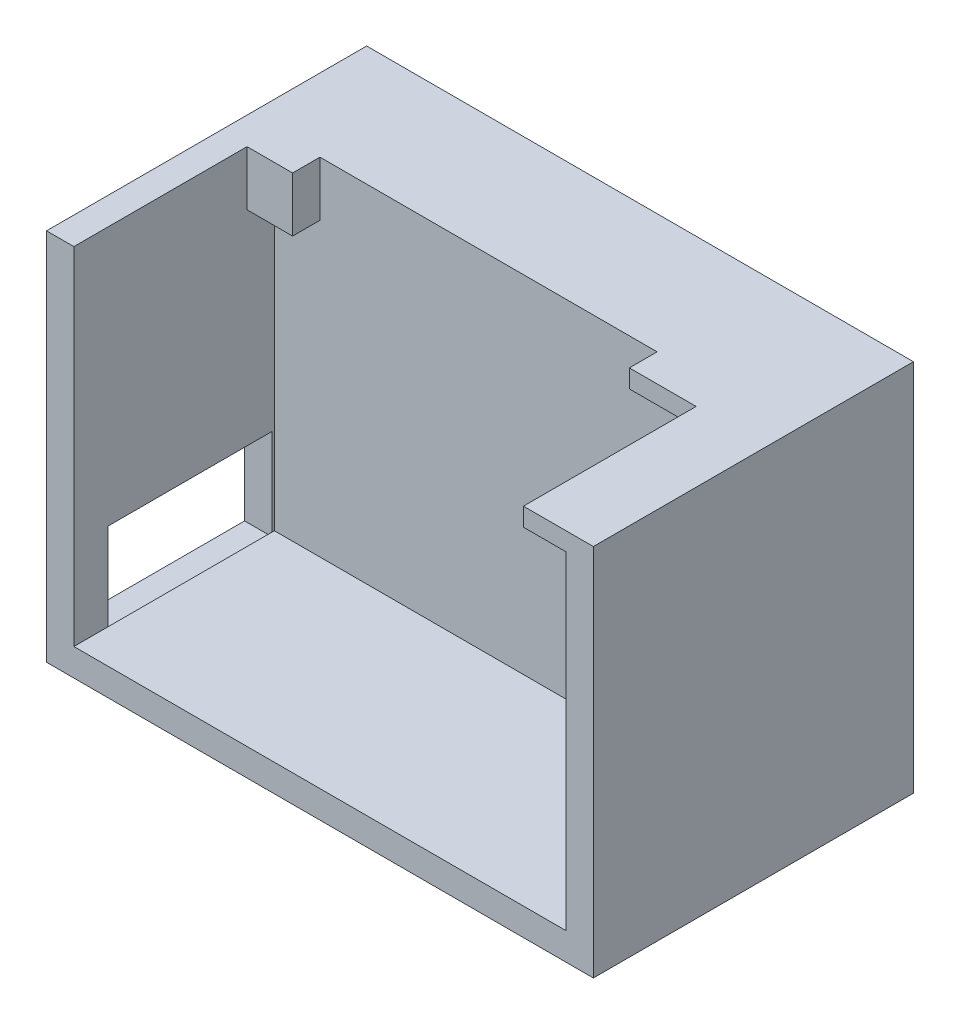
ISO-10303-21;
HEADER;
FILE_DESCRIPTION(('STEP AP214'),'2;1');
FILE_NAME('part.step','',(''),(''),'','','');
FILE_SCHEMA(('AUTOMOTIVE_DESIGN { 1 0 10303 214 1 1 1 1 }'));
ENDSEC;
DATA;
#1=APPLICATION_CONTEXT('core data for automotive mechanical design processes');
#2=APPLICATION_PROTOCOL_DEFINITION('international standard','automotive_design',2000,#1);
#3=PRODUCT_CONTEXT('',#1,'mechanical');
#4=PRODUCT('Part','Part','',(#3));
#5=PRODUCT_RELATED_PRODUCT_CATEGORY('part','',(#4));
#6=PRODUCT_DEFINITION_FORMATION('','',#4);
#7=PRODUCT_DEFINITION_CONTEXT('part definition',#1,'design');
#8=PRODUCT_DEFINITION('design','',#6,#7);
#9=PRODUCT_DEFINITION_SHAPE('','',#8);
#10=(LENGTH_UNIT() NAMED_UNIT(*) SI_UNIT(.MILLI.,.METRE.));
#11=(NAMED_UNIT(*) PLANE_ANGLE_UNIT() SI_UNIT($,.RADIAN.));
#12=(NAMED_UNIT(*) SI_UNIT($,.STERADIAN.) SOLID_ANGLE_UNIT());
#13=UNCERTAINTY_MEASURE_WITH_UNIT(LENGTH_MEASURE(1.E-05),#10,'distance_accuracy_value','');
#14=(GEOMETRIC_REPRESENTATION_CONTEXT(3) GLOBAL_UNCERTAINTY_ASSIGNED_CONTEXT((#13)) GLOBAL_UNIT_ASSIGNED_CONTEXT((#10,
#11,#12)) REPRESENTATION_CONTEXT('',''));
#15=CARTESIAN_POINT('',(0.,0.,0.));
#16=DIRECTION('',(0.,0.,1.));
#17=DIRECTION('',(1.,0.,0.));
#18=AXIS2_PLACEMENT_3D('',#15,#16,#17);
#19=CARTESIAN_POINT('',(3.,0.,35.125));
#20=DIRECTION('',(1.,0.,0.));
#21=DIRECTION('',(0.,1.,0.));
#22=AXIS2_PLACEMENT_3D('',#19,#20,#21);
#23=PLANE('',#22);
#24=DIRECTION('',(0.,-1.,0.));
#25=VECTOR('',#24,1.);
#26=CARTESIAN_POINT('',(2.99999999999999,39.,13.125));
#27=LINE('',#26,#25);
#28=CARTESIAN_POINT('',(2.99999999999999,35.,13.125));
#29=VERTEX_POINT('',#28);
#30=CARTESIAN_POINT('',(3.,3.,13.125));
#31=VERTEX_POINT('',#30);
#32=EDGE_CURVE('E270',#29,#31,#27,.T.);
#33=ORIENTED_EDGE('',*,*,#32,.F.);
#34=DIRECTION('',(0.,0.,-1.));
#35=VECTOR('',#34,1.);
#36=CARTESIAN_POINT('',(2.99999999999999,35.,16.125));
#37=LINE('',#36,#35);
#38=CARTESIAN_POINT('',(2.99999999999999,35.,16.125));
#39=VERTEX_POINT('',#38);
#40=EDGE_CURVE('E58',#39,#29,#37,.T.);
#41=ORIENTED_EDGE('',*,*,#40,.F.);
#42=DIRECTION('',(0.,-1.,0.));
#43=VECTOR('',#42,1.);
#44=CARTESIAN_POINT('',(2.99999999999999,41.,16.125));
#45=LINE('',#44,#43);
#46=CARTESIAN_POINT('',(2.99999999999999,41.,16.125));
#47=VERTEX_POINT('',#46);
#48=EDGE_CURVE('E187',#47,#39,#45,.T.);
#49=ORIENTED_EDGE('',*,*,#48,.F.);
#50=DIRECTION('',(0.,0.,1.));
#51=VECTOR('',#50,1.);
#52=CARTESIAN_POINT('',(2.99999999999999,41.,0.));
#53=LINE('',#52,#51);
#54=CARTESIAN_POINT('',(2.99999999999999,41.,35.125));
#55=VERTEX_POINT('',#54);
#56=EDGE_CURVE('E51',#47,#55,#53,.T.);
#57=ORIENTED_EDGE('',*,*,#56,.T.);
#58=DIRECTION('',(0.,-1.,0.));
#59=VECTOR('',#58,1.);
#60=CARTESIAN_POINT('',(3.,0.,35.125));
#61=LINE('',#60,#59);
#62=CARTESIAN_POINT('',(3.,3.,35.125));
#63=VERTEX_POINT('',#62);
#64=EDGE_CURVE('E281',#55,#63,#61,.T.);
#65=ORIENTED_EDGE('',*,*,#64,.T.);
#66=DIRECTION('',(0.,0.,-1.));
#67=VECTOR('',#66,1.);
#68=CARTESIAN_POINT('',(3.,3.,35.125));
#69=LINE('',#68,#67);
#70=CARTESIAN_POINT('',(3.,3.,31.3951101952654));
#71=VERTEX_POINT('',#70);
#72=EDGE_CURVE('E282',#63,#71,#69,.T.);
#73=ORIENTED_EDGE('',*,*,#72,.T.);
#74=DIRECTION('',(0.,1.,0.));
#75=VECTOR('',#74,1.);
#76=CARTESIAN_POINT('',(3.,12.5683185883645,31.3951101952654));
#77=LINE('',#76,#75);
#78=CARTESIAN_POINT('',(3.,12.5683185883645,31.3951101952654));
#79=VERTEX_POINT('',#78);
#80=EDGE_CURVE('E235',#71,#79,#77,.T.);
#81=ORIENTED_EDGE('',*,*,#80,.T.);
#82=DIRECTION('',(0.,0.,-1.));
#83=VECTOR('',#82,1.);
#84=CARTESIAN_POINT('',(3.,12.5683185883645,13.3951101952654));
#85=LINE('',#84,#83);
#86=CARTESIAN_POINT('',(3.,12.5683185883645,13.3951101952654));
#87=VERTEX_POINT('',#86);
#88=EDGE_CURVE('E238',#79,#87,#85,.T.);
#89=ORIENTED_EDGE('',*,*,#88,.T.);
#90=DIRECTION('',(0.,-1.,0.));
#91=VECTOR('',#90,1.);
#92=CARTESIAN_POINT('',(3.,12.5683185883645,13.3951101952654));
#93=LINE('',#92,#91);
#94=CARTESIAN_POINT('',(3.,3.,13.3951101952654));
#95=VERTEX_POINT('',#94);
#96=EDGE_CURVE('E228',#87,#95,#93,.T.);
#97=ORIENTED_EDGE('',*,*,#96,.T.);
#98=EDGE_CURVE('E287',#95,#31,#69,.T.);
#99=ORIENTED_EDGE('',*,*,#98,.T.);
#100=EDGE_LOOP('',(#33,#41,#49,#57,#65,#73,#81,#89,#97,#99));
#101=FACE_BOUND('',#100,.T.);
#102=ADVANCED_FACE('F43',(#101),#23,.T.);
#103=CARTESIAN_POINT('',(0.,0.,13.125));
#104=DIRECTION('',(0.,0.,1.));
#105=DIRECTION('',(1.,0.,0.));
#106=AXIS2_PLACEMENT_3D('',#103,#104,#105);
#107=PLANE('',#106);
#108=DIRECTION('',(0.,1.,0.));
#109=VECTOR('',#108,1.);
#110=CARTESIAN_POINT('',(7.99999999999999,41.,13.125));
#111=LINE('',#110,#109);
#112=CARTESIAN_POINT('',(7.99999999999999,35.,13.125));
#113=VERTEX_POINT('',#112);
#114=CARTESIAN_POINT('',(7.99999999999999,41.,13.125));
#115=VERTEX_POINT('',#114);
#116=EDGE_CURVE('E66',#113,#115,#111,.T.);
#117=ORIENTED_EDGE('',*,*,#116,.F.);
#118=DIRECTION('',(1.,0.,0.));
#119=VECTOR('',#118,1.);
#120=CARTESIAN_POINT('',(2.99999999999999,35.,13.125));
#121=LINE('',#120,#119);
#122=EDGE_CURVE('E193',#29,#113,#121,.T.);
#123=ORIENTED_EDGE('',*,*,#122,.F.);
#124=ORIENTED_EDGE('',*,*,#32,.T.);
#125=DIRECTION('',(1.,0.,0.));
#126=VECTOR('',#125,1.);
#127=CARTESIAN_POINT('',(3.,3.,13.125));
#128=LINE('',#127,#126);
#129=CARTESIAN_POINT('',(57.,3.,13.125));
#130=VERTEX_POINT('',#129);
#131=EDGE_CURVE('E272',#31,#130,#128,.T.);
#132=ORIENTED_EDGE('',*,*,#131,.T.);
#133=DIRECTION('',(0.,1.,0.));
#134=VECTOR('',#133,1.);
#135=CARTESIAN_POINT('',(57.,39.,13.125));
#136=LINE('',#135,#134);
#137=CARTESIAN_POINT('',(57.,39.,13.125));
#138=VERTEX_POINT('',#137);
#139=EDGE_CURVE('E275',#130,#138,#136,.T.);
#140=ORIENTED_EDGE('',*,*,#139,.T.);
#141=DIRECTION('',(-1.,0.,0.));
#142=VECTOR('',#141,1.);
#143=CARTESIAN_POINT('',(2.99999999999999,39.,13.125));
#144=LINE('',#143,#142);
#145=CARTESIAN_POINT('',(45.,39.,13.125));
#146=VERTEX_POINT('',#145);
#147=EDGE_CURVE('E278',#138,#146,#144,.T.);
#148=ORIENTED_EDGE('',*,*,#147,.T.);
#149=DIRECTION('',(0.,-1.,0.));
#150=VECTOR('',#149,1.);
#151=CARTESIAN_POINT('',(45.,49.,13.125));
#152=LINE('',#151,#150);
#153=CARTESIAN_POINT('',(45.,41.,13.125));
#154=VERTEX_POINT('',#153);
#155=EDGE_CURVE('E225',#154,#146,#152,.T.);
#156=ORIENTED_EDGE('',*,*,#155,.F.);
#157=DIRECTION('',(-1.,0.,0.));
#158=VECTOR('',#157,1.);
#159=CARTESIAN_POINT('',(0.,41.,13.125));
#160=LINE('',#159,#158);
#161=EDGE_CURVE('E322',#154,#115,#160,.T.);
#162=ORIENTED_EDGE('',*,*,#161,.T.);
#163=EDGE_LOOP('',(#117,#123,#124,#132,#140,#148,#156,#162));
#164=FACE_BOUND('',#163,.T.);
#165=ADVANCED_FACE('F374',(#164),#107,.T.);
#166=CARTESIAN_POINT('',(0.,0.,35.125));
#167=DIRECTION('',(0.,0.,-1.));
#168=DIRECTION('',(-1.,0.,0.));
#169=AXIS2_PLACEMENT_3D('',#166,#167,#168);
#170=PLANE('',#169);
#171=DIRECTION('',(1.,0.,0.));
#172=VECTOR('',#171,1.);
#173=CARTESIAN_POINT('',(0.,41.,35.125));
#174=LINE('',#173,#172);
#175=CARTESIAN_POINT('',(52.3263332393032,41.,35.125));
#176=VERTEX_POINT('',#175);
#177=CARTESIAN_POINT('',(60.,41.,35.125));
#178=VERTEX_POINT('',#177);
#179=EDGE_CURVE('E262',#176,#178,#174,.T.);
#180=ORIENTED_EDGE('',*,*,#179,.F.);
#181=DIRECTION('',(0.,1.,0.));
#182=VECTOR('',#181,1.);
#183=CARTESIAN_POINT('',(52.3263332393032,37.,35.125));
#184=LINE('',#183,#182);
#185=CARTESIAN_POINT('',(52.3263332393032,39.,35.125));
#186=VERTEX_POINT('',#185);
#187=EDGE_CURVE('E214',#186,#176,#184,.T.);
#188=ORIENTED_EDGE('',*,*,#187,.F.);
#189=DIRECTION('',(-1.,0.,0.));
#190=VECTOR('',#189,1.);
#191=CARTESIAN_POINT('',(0.,39.,35.125));
#192=LINE('',#191,#190);
#193=CARTESIAN_POINT('',(57.,39.,35.125));
#194=VERTEX_POINT('',#193);
#195=EDGE_CURVE('E294',#194,#186,#192,.T.);
#196=ORIENTED_EDGE('',*,*,#195,.F.);
#197=DIRECTION('',(0.,1.,0.));
#198=VECTOR('',#197,1.);
#199=CARTESIAN_POINT('',(57.,0.,35.125));
#200=LINE('',#199,#198);
#201=CARTESIAN_POINT('',(57.,3.,35.125));
#202=VERTEX_POINT('',#201);
#203=EDGE_CURVE('E298',#202,#194,#200,.T.);
#204=ORIENTED_EDGE('',*,*,#203,.F.);
#205=DIRECTION('',(1.,0.,0.));
#206=VECTOR('',#205,1.);
#207=CARTESIAN_POINT('',(0.,3.,35.125));
#208=LINE('',#207,#206);
#209=EDGE_CURVE('E296',#63,#202,#208,.T.);
#210=ORIENTED_EDGE('',*,*,#209,.F.);
#211=ORIENTED_EDGE('',*,*,#64,.F.);
#212=CARTESIAN_POINT('',(0.,41.,35.125));
#213=VERTEX_POINT('',#212);
#214=EDGE_CURVE('E263',#213,#55,#174,.T.);
#215=ORIENTED_EDGE('',*,*,#214,.F.);
#216=DIRECTION('',(0.,-1.,0.));
#217=VECTOR('',#216,1.);
#218=CARTESIAN_POINT('',(0.,0.,35.125));
#219=LINE('',#218,#217);
#220=CARTESIAN_POINT('',(0.,0.,35.125));
#221=VERTEX_POINT('',#220);
#222=EDGE_CURVE('E303',#213,#221,#219,.T.);
#223=ORIENTED_EDGE('',*,*,#222,.T.);
#224=DIRECTION('',(1.,0.,0.));
#225=VECTOR('',#224,1.);
#226=CARTESIAN_POINT('',(0.,0.,35.125));
#227=LINE('',#226,#225);
#228=CARTESIAN_POINT('',(60.,0.,35.125));
#229=VERTEX_POINT('',#228);
#230=EDGE_CURVE('E305',#221,#229,#227,.T.);
#231=ORIENTED_EDGE('',*,*,#230,.T.);
#232=DIRECTION('',(0.,1.,0.));
#233=VECTOR('',#232,1.);
#234=CARTESIAN_POINT('',(60.,0.,35.125));
#235=LINE('',#234,#233);
#236=EDGE_CURVE('E308',#229,#178,#235,.T.);
#237=ORIENTED_EDGE('',*,*,#236,.T.);
#238=EDGE_LOOP('',(#180,#188,#196,#204,#210,#211,#215,#223,#231,#237));
#239=FACE_BOUND('',#238,.T.);
#240=ADVANCED_FACE('F333',(#239),#170,.F.);
#241=CARTESIAN_POINT('',(0.,0.,35.125));
#242=DIRECTION('',(1.,0.,0.));
#243=DIRECTION('',(0.,1.,0.));
#244=AXIS2_PLACEMENT_3D('',#241,#242,#243);
#245=PLANE('',#244);
#246=DIRECTION('',(0.,0.,1.));
#247=VECTOR('',#246,1.);
#248=CARTESIAN_POINT('',(0.,2.56831858836449,13.3951101952654));
#249=LINE('',#248,#247);
#250=CARTESIAN_POINT('',(0.,2.56831858836449,13.3951101952654));
#251=VERTEX_POINT('',#250);
#252=CARTESIAN_POINT('',(0.,2.56831858836449,31.3951101952654));
#253=VERTEX_POINT('',#252);
#254=EDGE_CURVE('E243',#251,#253,#249,.T.);
#255=ORIENTED_EDGE('',*,*,#254,.F.);
#256=DIRECTION('',(0.,-1.,0.));
#257=VECTOR('',#256,1.);
#258=CARTESIAN_POINT('',(0.,12.5683185883645,13.3951101952654));
#259=LINE('',#258,#257);
#260=CARTESIAN_POINT('',(0.,12.5683185883645,13.3951101952654));
#261=VERTEX_POINT('',#260);
#262=EDGE_CURVE('E227',#261,#251,#259,.T.);
#263=ORIENTED_EDGE('',*,*,#262,.F.);
#264=DIRECTION('',(0.,0.,-1.));
#265=VECTOR('',#264,1.);
#266=CARTESIAN_POINT('',(0.,12.5683185883645,13.3951101952654));
#267=LINE('',#266,#265);
#268=CARTESIAN_POINT('',(0.,12.5683185883645,31.3951101952654));
#269=VERTEX_POINT('',#268);
#270=EDGE_CURVE('E249',#269,#261,#267,.T.);
#271=ORIENTED_EDGE('',*,*,#270,.F.);
#272=DIRECTION('',(0.,1.,0.));
#273=VECTOR('',#272,1.);
#274=CARTESIAN_POINT('',(0.,12.5683185883645,31.3951101952654));
#275=LINE('',#274,#273);
#276=EDGE_CURVE('E246',#253,#269,#275,.T.);
#277=ORIENTED_EDGE('',*,*,#276,.F.);
#278=EDGE_LOOP('',(#255,#263,#271,#277));
#279=FACE_BOUND('',#278,.T.);
#280=DIRECTION('',(0.,0.,1.));
#281=VECTOR('',#280,1.);
#282=CARTESIAN_POINT('',(0.,41.,0.));
#283=LINE('',#282,#281);
#284=CARTESIAN_POINT('',(0.,41.,0.));
#285=VERTEX_POINT('',#284);
#286=EDGE_CURVE('E254',#285,#213,#283,.T.);
#287=ORIENTED_EDGE('',*,*,#286,.F.);
#288=DIRECTION('',(0.,-1.,0.));
#289=VECTOR('',#288,1.);
#290=CARTESIAN_POINT('',(0.,0.,0.));
#291=LINE('',#290,#289);
#292=CARTESIAN_POINT('',(0.,0.,0.));
#293=VERTEX_POINT('',#292);
#294=EDGE_CURVE('E285',#285,#293,#291,.T.);
#295=ORIENTED_EDGE('',*,*,#294,.T.);
#296=DIRECTION('',(0.,0.,-1.));
#297=VECTOR('',#296,1.);
#298=CARTESIAN_POINT('',(0.,0.,35.125));
#299=LINE('',#298,#297);
#300=EDGE_CURVE('E319',#221,#293,#299,.T.);
#301=ORIENTED_EDGE('',*,*,#300,.F.);
#302=ORIENTED_EDGE('',*,*,#222,.F.);
#303=EDGE_LOOP('',(#287,#295,#301,#302));
#304=FACE_BOUND('',#303,.T.);
#305=ADVANCED_FACE('F45',(#279,#304),#245,.F.);
#306=CARTESIAN_POINT('',(60.,0.,35.125));
#307=DIRECTION('',(-1.,0.,0.));
#308=DIRECTION('',(0.,0.,1.));
#309=AXIS2_PLACEMENT_3D('',#306,#307,#308);
#310=PLANE('',#309);
#311=DIRECTION('',(0.,1.,0.));
#312=VECTOR('',#311,1.);
#313=CARTESIAN_POINT('',(60.,0.,0.));
#314=LINE('',#313,#312);
#315=CARTESIAN_POINT('',(60.,0.,0.));
#316=VERTEX_POINT('',#315);
#317=CARTESIAN_POINT('',(60.,41.,0.));
#318=VERTEX_POINT('',#317);
#319=EDGE_CURVE('E306',#316,#318,#314,.T.);
#320=ORIENTED_EDGE('',*,*,#319,.T.);
#321=DIRECTION('',(0.,0.,-1.));
#322=VECTOR('',#321,1.);
#323=CARTESIAN_POINT('',(60.,41.,0.));
#324=LINE('',#323,#322);
#325=EDGE_CURVE('E266',#178,#318,#324,.T.);
#326=ORIENTED_EDGE('',*,*,#325,.F.);
#327=ORIENTED_EDGE('',*,*,#236,.F.);
#328=DIRECTION('',(0.,0.,-1.));
#329=VECTOR('',#328,1.);
#330=CARTESIAN_POINT('',(60.,0.,35.125));
#331=LINE('',#330,#329);
#332=EDGE_CURVE('E311',#229,#316,#331,.T.);
#333=ORIENTED_EDGE('',*,*,#332,.T.);
#334=EDGE_LOOP('',(#320,#326,#327,#333));
#335=FACE_BOUND('',#334,.T.);
#336=ADVANCED_FACE('F354',(#335),#310,.F.);
#337=CARTESIAN_POINT('',(0.,0.,0.));
#338=DIRECTION('',(0.,0.,-1.));
#339=DIRECTION('',(-1.,0.,0.));
#340=AXIS2_PLACEMENT_3D('',#337,#338,#339);
#341=PLANE('',#340);
#342=ORIENTED_EDGE('',*,*,#294,.F.);
#343=DIRECTION('',(-1.,0.,0.));
#344=VECTOR('',#343,1.);
#345=CARTESIAN_POINT('',(0.,41.,0.));
#346=LINE('',#345,#344);
#347=EDGE_CURVE('E268',#318,#285,#346,.T.);
#348=ORIENTED_EDGE('',*,*,#347,.F.);
#349=ORIENTED_EDGE('',*,*,#319,.F.);
#350=DIRECTION('',(1.,0.,0.));
#351=VECTOR('',#350,1.);
#352=CARTESIAN_POINT('',(0.,0.,0.));
#353=LINE('',#352,#351);
#354=EDGE_CURVE('E313',#293,#316,#353,.T.);
#355=ORIENTED_EDGE('',*,*,#354,.F.);
#356=EDGE_LOOP('',(#342,#348,#349,#355));
#357=FACE_BOUND('',#356,.T.);
#358=ADVANCED_FACE('F344',(#357),#341,.T.);
#359=CARTESIAN_POINT('',(0.,0.,35.125));
#360=DIRECTION('',(0.,1.,0.));
#361=DIRECTION('',(0.,0.,1.));
#362=AXIS2_PLACEMENT_3D('',#359,#360,#361);
#363=PLANE('',#362);
#364=ORIENTED_EDGE('',*,*,#354,.T.);
#365=ORIENTED_EDGE('',*,*,#332,.F.);
#366=ORIENTED_EDGE('',*,*,#230,.F.);
#367=ORIENTED_EDGE('',*,*,#300,.T.);
#368=EDGE_LOOP('',(#364,#365,#366,#367));
#369=FACE_BOUND('',#368,.T.);
#370=ADVANCED_FACE('F349',(#369),#363,.F.);
#371=CARTESIAN_POINT('',(0.,3.,35.125));
#372=DIRECTION('',(0.,1.,0.));
#373=DIRECTION('',(0.,0.,1.));
#374=AXIS2_PLACEMENT_3D('',#371,#372,#373);
#375=PLANE('',#374);
#376=ORIENTED_EDGE('',*,*,#131,.F.);
#377=ORIENTED_EDGE('',*,*,#98,.F.);
#378=EDGE_CURVE('E286',#71,#95,#69,.T.);
#379=ORIENTED_EDGE('',*,*,#378,.F.);
#380=ORIENTED_EDGE('',*,*,#72,.F.);
#381=ORIENTED_EDGE('',*,*,#209,.T.);
#382=DIRECTION('',(0.,0.,-1.));
#383=VECTOR('',#382,1.);
#384=CARTESIAN_POINT('',(57.,3.,35.125));
#385=LINE('',#384,#383);
#386=EDGE_CURVE('E288',#202,#130,#385,.T.);
#387=ORIENTED_EDGE('',*,*,#386,.T.);
#388=EDGE_LOOP('',(#376,#377,#379,#380,#381,#387));
#389=FACE_BOUND('',#388,.T.);
#390=ADVANCED_FACE('F372',(#389),#375,.T.);
#391=CARTESIAN_POINT('',(57.,0.,35.125));
#392=DIRECTION('',(-1.,0.,0.));
#393=DIRECTION('',(0.,0.,1.));
#394=AXIS2_PLACEMENT_3D('',#391,#392,#393);
#395=PLANE('',#394);
#396=ORIENTED_EDGE('',*,*,#139,.F.);
#397=ORIENTED_EDGE('',*,*,#386,.F.);
#398=ORIENTED_EDGE('',*,*,#203,.T.);
#399=DIRECTION('',(0.,0.,-1.));
#400=VECTOR('',#399,1.);
#401=CARTESIAN_POINT('',(57.,39.,35.125));
#402=LINE('',#401,#400);
#403=EDGE_CURVE('E291',#194,#138,#402,.T.);
#404=ORIENTED_EDGE('',*,*,#403,.T.);
#405=EDGE_LOOP('',(#396,#397,#398,#404));
#406=FACE_BOUND('',#405,.T.);
#407=ADVANCED_FACE('F369',(#406),#395,.T.);
#408=CARTESIAN_POINT('',(0.,39.,35.125));
#409=DIRECTION('',(0.,-1.,0.));
#410=DIRECTION('',(0.,0.,-1.));
#411=AXIS2_PLACEMENT_3D('',#408,#409,#410);
#412=PLANE('',#411);
#413=DIRECTION('',(1.,0.,0.));
#414=VECTOR('',#413,1.);
#415=CARTESIAN_POINT('',(0.,39.,16.1742051286222));
#416=LINE('',#415,#414);
#417=CARTESIAN_POINT('',(45.,39.,16.1742051286222));
#418=VERTEX_POINT('',#417);
#419=CARTESIAN_POINT('',(52.3263332393032,39.,16.1742051286222));
#420=VERTEX_POINT('',#419);
#421=EDGE_CURVE('E217',#418,#420,#416,.T.);
#422=ORIENTED_EDGE('',*,*,#421,.F.);
#423=DIRECTION('',(0.,0.,1.));
#424=VECTOR('',#423,1.);
#425=CARTESIAN_POINT('',(45.,39.,35.125));
#426=LINE('',#425,#424);
#427=EDGE_CURVE('E222',#146,#418,#426,.T.);
#428=ORIENTED_EDGE('',*,*,#427,.F.);
#429=ORIENTED_EDGE('',*,*,#147,.F.);
#430=ORIENTED_EDGE('',*,*,#403,.F.);
#431=ORIENTED_EDGE('',*,*,#195,.T.);
#432=DIRECTION('',(0.,0.,1.));
#433=VECTOR('',#432,1.);
#434=CARTESIAN_POINT('',(52.3263332393032,39.,35.125));
#435=LINE('',#434,#433);
#436=EDGE_CURVE('E220',#420,#186,#435,.T.);
#437=ORIENTED_EDGE('',*,*,#436,.F.);
#438=EDGE_LOOP('',(#422,#428,#429,#430,#431,#437));
#439=FACE_BOUND('',#438,.T.);
#440=ADVANCED_FACE('F365',(#439),#412,.T.);
#441=CARTESIAN_POINT('',(0.,41.,0.));
#442=DIRECTION('',(0.,1.,0.));
#443=DIRECTION('',(0.,0.,1.));
#444=AXIS2_PLACEMENT_3D('',#441,#442,#443);
#445=PLANE('',#444);
#446=ORIENTED_EDGE('',*,*,#56,.F.);
#447=DIRECTION('',(-1.,0.,0.));
#448=VECTOR('',#447,1.);
#449=CARTESIAN_POINT('',(2.99999999999999,41.,16.125));
#450=LINE('',#449,#448);
#451=CARTESIAN_POINT('',(7.99999999999999,41.,16.125));
#452=VERTEX_POINT('',#451);
#453=EDGE_CURVE('E200',#452,#47,#450,.T.);
#454=ORIENTED_EDGE('',*,*,#453,.F.);
#455=DIRECTION('',(0.,0.,-1.));
#456=VECTOR('',#455,1.);
#457=CARTESIAN_POINT('',(7.99999999999999,41.,16.125));
#458=LINE('',#457,#456);
#459=EDGE_CURVE('E195',#452,#115,#458,.T.);
#460=ORIENTED_EDGE('',*,*,#459,.T.);
#461=ORIENTED_EDGE('',*,*,#161,.F.);
#462=DIRECTION('',(0.,0.,-1.));
#463=VECTOR('',#462,1.);
#464=CARTESIAN_POINT('',(45.,41.,0.));
#465=LINE('',#464,#463);
#466=CARTESIAN_POINT('',(45.,41.,16.1742051286222));
#467=VERTEX_POINT('',#466);
#468=EDGE_CURVE('E324',#467,#154,#465,.T.);
#469=ORIENTED_EDGE('',*,*,#468,.F.);
#470=DIRECTION('',(-1.,0.,0.));
#471=VECTOR('',#470,1.);
#472=CARTESIAN_POINT('',(45.,41.,16.1742051286222));
#473=LINE('',#472,#471);
#474=CARTESIAN_POINT('',(52.3263332393032,41.,16.1742051286222));
#475=VERTEX_POINT('',#474);
#476=EDGE_CURVE('E212',#475,#467,#473,.T.);
#477=ORIENTED_EDGE('',*,*,#476,.F.);
#478=DIRECTION('',(0.,0.,-1.));
#479=VECTOR('',#478,1.);
#480=CARTESIAN_POINT('',(52.3263332393032,41.,35.125));
#481=LINE('',#480,#479);
#482=EDGE_CURVE('E209',#176,#475,#481,.T.);
#483=ORIENTED_EDGE('',*,*,#482,.F.);
#484=ORIENTED_EDGE('',*,*,#179,.T.);
#485=ORIENTED_EDGE('',*,*,#325,.T.);
#486=ORIENTED_EDGE('',*,*,#347,.T.);
#487=ORIENTED_EDGE('',*,*,#286,.T.);
#488=ORIENTED_EDGE('',*,*,#214,.T.);
#489=EDGE_LOOP('',(#446,#454,#460,#461,#469,#477,#483,#484,#485,#486,#487,#488));
#490=FACE_BOUND('',#489,.T.);
#491=ADVANCED_FACE('F336',(#490),#445,.T.);
#492=CARTESIAN_POINT('',(3.,12.5683185883645,13.3951101952654));
#493=DIRECTION('',(0.,0.,-1.));
#494=DIRECTION('',(0.,1.,0.));
#495=AXIS2_PLACEMENT_3D('',#492,#493,#494);
#496=PLANE('',#495);
#497=ORIENTED_EDGE('',*,*,#262,.T.);
#498=DIRECTION('',(-1.,0.,0.));
#499=VECTOR('',#498,1.);
#500=CARTESIAN_POINT('',(3.,2.56831858836449,13.3951101952654));
#501=LINE('',#500,#499);
#502=CARTESIAN_POINT('',(3.,2.56831858836449,13.3951101952654));
#503=VERTEX_POINT('',#502);
#504=EDGE_CURVE('E241',#503,#251,#501,.T.);
#505=ORIENTED_EDGE('',*,*,#504,.F.);
#506=EDGE_CURVE('E232',#95,#503,#93,.T.);
#507=ORIENTED_EDGE('',*,*,#506,.F.);
#508=ORIENTED_EDGE('',*,*,#96,.F.);
#509=DIRECTION('',(-1.,0.,0.));
#510=VECTOR('',#509,1.);
#511=CARTESIAN_POINT('',(3.,12.5683185883645,13.3951101952654));
#512=LINE('',#511,#510);
#513=EDGE_CURVE('E252',#87,#261,#512,.T.);
#514=ORIENTED_EDGE('',*,*,#513,.T.);
#515=EDGE_LOOP('',(#497,#505,#507,#508,#514));
#516=FACE_BOUND('',#515,.T.);
#517=ADVANCED_FACE('F385',(#516),#496,.F.);
#518=CARTESIAN_POINT('',(3.,12.5683185883645,13.3951101952654));
#519=DIRECTION('',(0.,1.,0.));
#520=DIRECTION('',(0.,0.,1.));
#521=AXIS2_PLACEMENT_3D('',#518,#519,#520);
#522=PLANE('',#521);
#523=ORIENTED_EDGE('',*,*,#270,.T.);
#524=ORIENTED_EDGE('',*,*,#513,.F.);
#525=ORIENTED_EDGE('',*,*,#88,.F.);
#526=DIRECTION('',(-1.,0.,0.));
#527=VECTOR('',#526,1.);
#528=CARTESIAN_POINT('',(3.,12.5683185883645,31.3951101952654));
#529=LINE('',#528,#527);
#530=EDGE_CURVE('E255',#79,#269,#529,.T.);
#531=ORIENTED_EDGE('',*,*,#530,.T.);
#532=EDGE_LOOP('',(#523,#524,#525,#531));
#533=FACE_BOUND('',#532,.T.);
#534=ADVANCED_FACE('F397',(#533),#522,.F.);
#535=CARTESIAN_POINT('',(3.,12.5683185883645,31.3951101952654));
#536=DIRECTION('',(0.,0.,1.));
#537=DIRECTION('',(1.,0.,0.));
#538=AXIS2_PLACEMENT_3D('',#535,#536,#537);
#539=PLANE('',#538);
#540=ORIENTED_EDGE('',*,*,#276,.T.);
#541=ORIENTED_EDGE('',*,*,#530,.F.);
#542=ORIENTED_EDGE('',*,*,#80,.F.);
#543=CARTESIAN_POINT('',(3.,2.56831858836449,31.3951101952654));
#544=VERTEX_POINT('',#543);
#545=EDGE_CURVE('E236',#544,#71,#77,.T.);
#546=ORIENTED_EDGE('',*,*,#545,.F.);
#547=DIRECTION('',(-1.,0.,0.));
#548=VECTOR('',#547,1.);
#549=CARTESIAN_POINT('',(3.,2.56831858836449,31.3951101952654));
#550=LINE('',#549,#548);
#551=EDGE_CURVE('E257',#544,#253,#550,.T.);
#552=ORIENTED_EDGE('',*,*,#551,.T.);
#553=EDGE_LOOP('',(#540,#541,#542,#546,#552));
#554=FACE_BOUND('',#553,.T.);
#555=ADVANCED_FACE('F393',(#554),#539,.F.);
#556=CARTESIAN_POINT('',(3.,2.56831858836449,13.3951101952654));
#557=DIRECTION('',(0.,-1.,0.));
#558=DIRECTION('',(0.,0.,-1.));
#559=AXIS2_PLACEMENT_3D('',#556,#557,#558);
#560=PLANE('',#559);
#561=ORIENTED_EDGE('',*,*,#254,.T.);
#562=ORIENTED_EDGE('',*,*,#551,.F.);
#563=DIRECTION('',(0.,0.,1.));
#564=VECTOR('',#563,1.);
#565=CARTESIAN_POINT('',(3.,2.56831858836449,13.3951101952654));
#566=LINE('',#565,#564);
#567=EDGE_CURVE('E231',#503,#544,#566,.T.);
#568=ORIENTED_EDGE('',*,*,#567,.F.);
#569=ORIENTED_EDGE('',*,*,#504,.T.);
#570=EDGE_LOOP('',(#561,#562,#568,#569));
#571=FACE_BOUND('',#570,.T.);
#572=ADVANCED_FACE('F390',(#571),#560,.F.);
#573=CARTESIAN_POINT('',(3.,0.,0.));
#574=DIRECTION('',(-1.,0.,0.));
#575=DIRECTION('',(0.,0.,1.));
#576=AXIS2_PLACEMENT_3D('',#573,#574,#575);
#577=PLANE('',#576);
#578=ORIENTED_EDGE('',*,*,#506,.T.);
#579=ORIENTED_EDGE('',*,*,#567,.T.);
#580=ORIENTED_EDGE('',*,*,#545,.T.);
#581=ORIENTED_EDGE('',*,*,#378,.T.);
#582=EDGE_LOOP('',(#578,#579,#580,#581));
#583=FACE_BOUND('',#582,.T.);
#584=ADVANCED_FACE('F380',(#583),#577,.T.);
#585=CARTESIAN_POINT('',(45.,49.,35.125));
#586=DIRECTION('',(1.,0.,0.));
#587=DIRECTION('',(0.,0.,-1.));
#588=AXIS2_PLACEMENT_3D('',#585,#586,#587);
#589=PLANE('',#588);
#590=ORIENTED_EDGE('',*,*,#427,.T.);
#591=DIRECTION('',(0.,1.,0.));
#592=VECTOR('',#591,1.);
#593=CARTESIAN_POINT('',(45.,49.,16.1742051286222));
#594=LINE('',#593,#592);
#595=EDGE_CURVE('E12',#418,#467,#594,.T.);
#596=ORIENTED_EDGE('',*,*,#595,.T.);
#597=ORIENTED_EDGE('',*,*,#468,.T.);
#598=ORIENTED_EDGE('',*,*,#155,.T.);
#599=EDGE_LOOP('',(#590,#596,#597,#598));
#600=FACE_BOUND('',#599,.T.);
#601=ADVANCED_FACE('F474',(#600),#589,.F.);
#602=CARTESIAN_POINT('',(45.,37.,16.1742051286222));
#603=DIRECTION('',(0.,0.,-1.));
#604=DIRECTION('',(-1.,0.,0.));
#605=AXIS2_PLACEMENT_3D('',#602,#603,#604);
#606=PLANE('',#605);
#607=ORIENTED_EDGE('',*,*,#421,.T.);
#608=DIRECTION('',(0.,1.,0.));
#609=VECTOR('',#608,1.);
#610=CARTESIAN_POINT('',(52.3263332393032,37.,16.1742051286222));
#611=LINE('',#610,#609);
#612=EDGE_CURVE('E215',#420,#475,#611,.T.);
#613=ORIENTED_EDGE('',*,*,#612,.T.);
#614=ORIENTED_EDGE('',*,*,#476,.T.);
#615=ORIENTED_EDGE('',*,*,#595,.F.);
#616=EDGE_LOOP('',(#607,#613,#614,#615));
#617=FACE_BOUND('',#616,.T.);
#618=ADVANCED_FACE('F481',(#617),#606,.F.);
#619=CARTESIAN_POINT('',(52.3263332393032,37.,35.125));
#620=DIRECTION('',(1.,0.,0.));
#621=DIRECTION('',(0.,0.,-1.));
#622=AXIS2_PLACEMENT_3D('',#619,#620,#621);
#623=PLANE('',#622);
#624=ORIENTED_EDGE('',*,*,#436,.T.);
#625=ORIENTED_EDGE('',*,*,#187,.T.);
#626=ORIENTED_EDGE('',*,*,#482,.T.);
#627=ORIENTED_EDGE('',*,*,#612,.F.);
#628=EDGE_LOOP('',(#624,#625,#626,#627));
#629=FACE_BOUND('',#628,.T.);
#630=ADVANCED_FACE('F360',(#629),#623,.F.);
#631=CARTESIAN_POINT('',(2.99999999999999,35.,16.125));
#632=DIRECTION('',(0.,1.,0.));
#633=DIRECTION('',(0.,0.,1.));
#634=AXIS2_PLACEMENT_3D('',#631,#632,#633);
#635=PLANE('',#634);
#636=ORIENTED_EDGE('',*,*,#122,.T.);
#637=DIRECTION('',(0.,0.,-1.));
#638=VECTOR('',#637,1.);
#639=CARTESIAN_POINT('',(7.99999999999999,35.,16.125));
#640=LINE('',#639,#638);
#641=CARTESIAN_POINT('',(7.99999999999999,35.,16.125));
#642=VERTEX_POINT('',#641);
#643=EDGE_CURVE('E191',#642,#113,#640,.T.);
#644=ORIENTED_EDGE('',*,*,#643,.F.);
#645=DIRECTION('',(1.,0.,0.));
#646=VECTOR('',#645,1.);
#647=CARTESIAN_POINT('',(2.99999999999999,35.,16.125));
#648=LINE('',#647,#646);
#649=EDGE_CURVE('E180',#39,#642,#648,.T.);
#650=ORIENTED_EDGE('',*,*,#649,.F.);
#651=ORIENTED_EDGE('',*,*,#40,.T.);
#652=EDGE_LOOP('',(#636,#644,#650,#651));
#653=FACE_BOUND('',#652,.T.);
#654=ADVANCED_FACE('F192',(#653),#635,.F.);
#655=CARTESIAN_POINT('',(7.99999999999999,41.,16.125));
#656=DIRECTION('',(-1.,0.,0.));
#657=DIRECTION('',(0.,0.,1.));
#658=AXIS2_PLACEMENT_3D('',#655,#656,#657);
#659=PLANE('',#658);
#660=ORIENTED_EDGE('',*,*,#116,.T.);
#661=ORIENTED_EDGE('',*,*,#459,.F.);
#662=DIRECTION('',(0.,1.,0.));
#663=VECTOR('',#662,1.);
#664=CARTESIAN_POINT('',(7.99999999999999,41.,16.125));
#665=LINE('',#664,#663);
#666=EDGE_CURVE('E185',#642,#452,#665,.T.);
#667=ORIENTED_EDGE('',*,*,#666,.F.);
#668=ORIENTED_EDGE('',*,*,#643,.T.);
#669=EDGE_LOOP('',(#660,#661,#667,#668));
#670=FACE_BOUND('',#669,.T.);
#671=ADVANCED_FACE('F197',(#670),#659,.F.);
#672=CARTESIAN_POINT('',(0.,0.,16.125));
#673=DIRECTION('',(0.,0.,1.));
#674=DIRECTION('',(1.,0.,0.));
#675=AXIS2_PLACEMENT_3D('',#672,#673,#674);
#676=PLANE('',#675);
#677=ORIENTED_EDGE('',*,*,#48,.T.);
#678=ORIENTED_EDGE('',*,*,#649,.T.);
#679=ORIENTED_EDGE('',*,*,#666,.T.);
#680=ORIENTED_EDGE('',*,*,#453,.T.);
#681=EDGE_LOOP('',(#677,#678,#679,#680));
#682=FACE_BOUND('',#681,.T.);
#683=ADVANCED_FACE('F182',(#682),#676,.T.);
#684=CLOSED_SHELL('',(#102,#165,#240,#305,#336,#358,#370,#390,#407,#440,#491,#517,#534,#555,
#572,#584,#601,#618,#630,#654,#671,#683));
#685=MANIFOLD_SOLID_BREP('B2',#684);
#686=ADVANCED_BREP_SHAPE_REPRESENTATION('',(#18,#685),#14);
#687=SHAPE_DEFINITION_REPRESENTATION(#9,#686);
ENDSEC;
END-ISO-10303-21;
